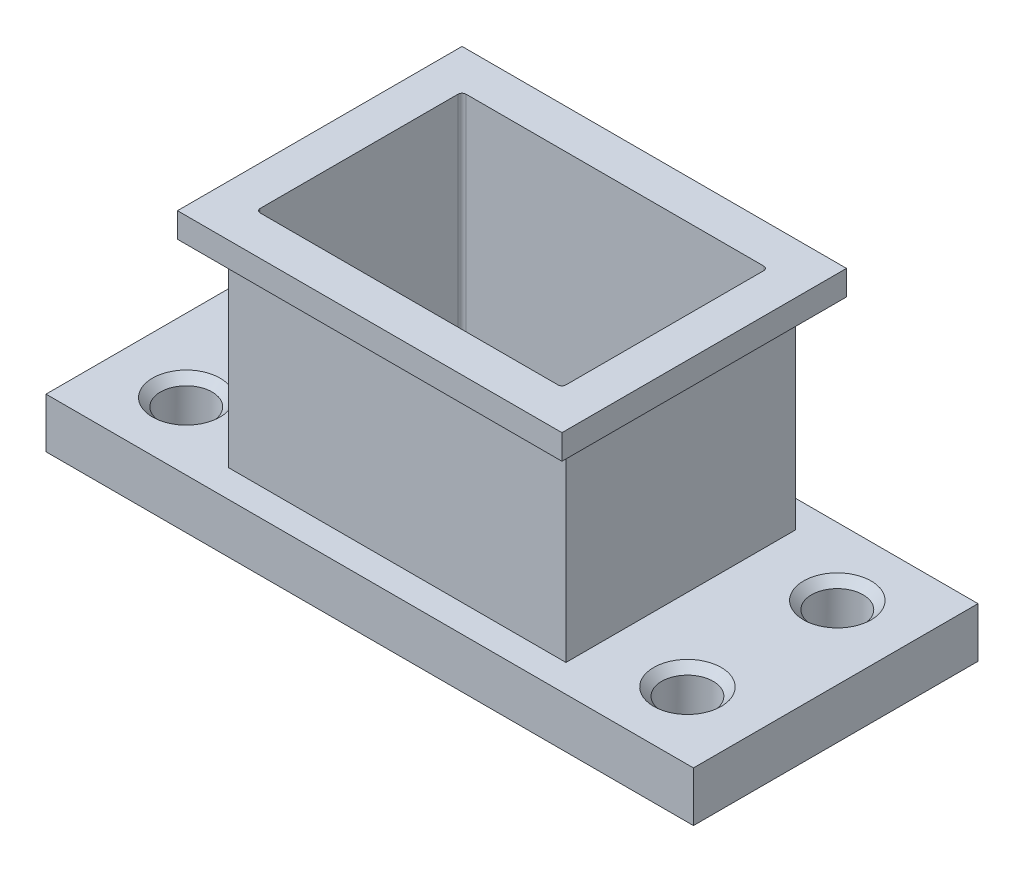
ISO-10303-21;
HEADER;
FILE_DESCRIPTION(('STEP AP214'),'2;1');
FILE_NAME('part.step','',(''),(''),'','','');
FILE_SCHEMA(('AUTOMOTIVE_DESIGN { 1 0 10303 214 1 1 1 1 }'));
ENDSEC;
DATA;
#1=APPLICATION_CONTEXT('core data for automotive mechanical design processes');
#2=APPLICATION_PROTOCOL_DEFINITION('international standard','automotive_design',2000,#1);
#3=PRODUCT_CONTEXT('',#1,'mechanical');
#4=PRODUCT('Part','Part','',(#3));
#5=PRODUCT_RELATED_PRODUCT_CATEGORY('part','',(#4));
#6=PRODUCT_DEFINITION_FORMATION('','',#4);
#7=PRODUCT_DEFINITION_CONTEXT('part definition',#1,'design');
#8=PRODUCT_DEFINITION('design','',#6,#7);
#9=PRODUCT_DEFINITION_SHAPE('','',#8);
#10=(LENGTH_UNIT() NAMED_UNIT(*) SI_UNIT(.MILLI.,.METRE.));
#11=(NAMED_UNIT(*) PLANE_ANGLE_UNIT() SI_UNIT($,.RADIAN.));
#12=(NAMED_UNIT(*) SI_UNIT($,.STERADIAN.) SOLID_ANGLE_UNIT());
#13=UNCERTAINTY_MEASURE_WITH_UNIT(LENGTH_MEASURE(1.E-05),#10,'distance_accuracy_value','');
#14=(GEOMETRIC_REPRESENTATION_CONTEXT(3) GLOBAL_UNCERTAINTY_ASSIGNED_CONTEXT((#13)) GLOBAL_UNIT_ASSIGNED_CONTEXT((#10,
#11,#12)) REPRESENTATION_CONTEXT('',''));
#15=CARTESIAN_POINT('',(0.,0.,0.));
#16=DIRECTION('',(0.,0.,1.));
#17=DIRECTION('',(1.,0.,0.));
#18=AXIS2_PLACEMENT_3D('',#15,#16,#17);
#19=CARTESIAN_POINT('',(0.,17.4498,0.));
#20=DIRECTION('',(0.,0.,-1.));
#21=DIRECTION('',(-1.,0.,0.));
#22=AXIS2_PLACEMENT_3D('',#19,#20,#21);
#23=PLANE('',#22);
#24=DIRECTION('',(0.,1.,0.));
#25=VECTOR('',#24,1.);
#26=CARTESIAN_POINT('',(8.35660000000001,3.175,0.));
#27=LINE('',#26,#25);
#28=CARTESIAN_POINT('',(8.35660000000001,15.875,0.));
#29=VERTEX_POINT('',#28);
#30=CARTESIAN_POINT('',(8.35660000000001,17.4498,0.));
#31=VERTEX_POINT('',#30);
#32=EDGE_CURVE('E230',#29,#31,#27,.T.);
#33=ORIENTED_EDGE('',*,*,#32,.F.);
#34=DIRECTION('',(1.,0.,0.));
#35=VECTOR('',#34,1.);
#36=CARTESIAN_POINT('',(8.35660000000001,15.875,0.));
#37=LINE('',#36,#35);
#38=CARTESIAN_POINT('',(32.7914,15.875,0.));
#39=VERTEX_POINT('',#38);
#40=EDGE_CURVE('E784',#29,#39,#37,.T.);
#41=ORIENTED_EDGE('',*,*,#40,.T.);
#42=DIRECTION('',(0.,1.,0.));
#43=VECTOR('',#42,1.);
#44=CARTESIAN_POINT('',(32.7914,3.175,0.));
#45=LINE('',#44,#43);
#46=CARTESIAN_POINT('',(32.7914,17.4498,0.));
#47=VERTEX_POINT('',#46);
#48=EDGE_CURVE('E218',#39,#47,#45,.T.);
#49=ORIENTED_EDGE('',*,*,#48,.T.);
#50=DIRECTION('',(1.,0.,0.));
#51=VECTOR('',#50,1.);
#52=CARTESIAN_POINT('',(0.,17.4498,0.));
#53=LINE('',#52,#51);
#54=EDGE_CURVE('E269',#31,#47,#53,.T.);
#55=ORIENTED_EDGE('',*,*,#54,.F.);
#56=EDGE_LOOP('',(#33,#41,#49,#55));
#57=FACE_BOUND('',#56,.T.);
#58=ADVANCED_FACE('F34',(#57),#23,.F.);
#59=CARTESIAN_POINT('',(0.,17.4498,-18.0848));
#60=DIRECTION('',(0.,0.,1.));
#61=DIRECTION('',(1.,0.,0.));
#62=AXIS2_PLACEMENT_3D('',#59,#60,#61);
#63=PLANE('',#62);
#64=DIRECTION('',(0.,1.,0.));
#65=VECTOR('',#64,1.);
#66=CARTESIAN_POINT('',(32.7914,3.17499999999997,-18.0848));
#67=LINE('',#66,#65);
#68=CARTESIAN_POINT('',(32.7914,15.875,-18.0848));
#69=VERTEX_POINT('',#68);
#70=CARTESIAN_POINT('',(32.7914,17.4498,-18.0848));
#71=VERTEX_POINT('',#70);
#72=EDGE_CURVE('E217',#69,#71,#67,.T.);
#73=ORIENTED_EDGE('',*,*,#72,.F.);
#74=DIRECTION('',(-1.,0.,0.));
#75=VECTOR('',#74,1.);
#76=CARTESIAN_POINT('',(32.7914,15.875,-18.0848));
#77=LINE('',#76,#75);
#78=CARTESIAN_POINT('',(8.35660000000001,15.875,-18.0848));
#79=VERTEX_POINT('',#78);
#80=EDGE_CURVE('E198',#69,#79,#77,.T.);
#81=ORIENTED_EDGE('',*,*,#80,.T.);
#82=DIRECTION('',(0.,1.,0.));
#83=VECTOR('',#82,1.);
#84=CARTESIAN_POINT('',(8.35660000000001,3.17499999999997,-18.0848));
#85=LINE('',#84,#83);
#86=CARTESIAN_POINT('',(8.35660000000001,17.4498,-18.0848));
#87=VERTEX_POINT('',#86);
#88=EDGE_CURVE('E231',#79,#87,#85,.T.);
#89=ORIENTED_EDGE('',*,*,#88,.T.);
#90=DIRECTION('',(-1.,0.,0.));
#91=VECTOR('',#90,1.);
#92=CARTESIAN_POINT('',(0.,17.4498,-18.0848));
#93=LINE('',#92,#91);
#94=EDGE_CURVE('E272',#71,#87,#93,.T.);
#95=ORIENTED_EDGE('',*,*,#94,.F.);
#96=EDGE_LOOP('',(#73,#81,#89,#95));
#97=FACE_BOUND('',#96,.T.);
#98=ADVANCED_FACE('F426',(#97),#63,.F.);
#99=CARTESIAN_POINT('',(0.,17.4498,0.));
#100=DIRECTION('',(1.,0.,0.));
#101=DIRECTION('',(0.,0.,-1.));
#102=AXIS2_PLACEMENT_3D('',#99,#100,#101);
#103=PLANE('',#102);
#104=DIRECTION('',(0.,0.,1.));
#105=VECTOR('',#104,1.);
#106=CARTESIAN_POINT('',(0.,3.17499999999997,-18.0848));
#107=LINE('',#106,#105);
#108=CARTESIAN_POINT('',(0.,3.17499999999997,-18.0848));
#109=VERTEX_POINT('',#108);
#110=CARTESIAN_POINT('',(0.,3.175,0.));
#111=VERTEX_POINT('',#110);
#112=EDGE_CURVE('E224',#109,#111,#107,.T.);
#113=ORIENTED_EDGE('',*,*,#112,.F.);
#114=DIRECTION('',(0.,-1.,0.));
#115=VECTOR('',#114,1.);
#116=CARTESIAN_POINT('',(0.,17.4498,-18.0848));
#117=LINE('',#116,#115);
#118=CARTESIAN_POINT('',(0.,0.,-18.0848));
#119=VERTEX_POINT('',#118);
#120=EDGE_CURVE('E275',#109,#119,#117,.T.);
#121=ORIENTED_EDGE('',*,*,#120,.T.);
#122=DIRECTION('',(0.,0.,1.));
#123=VECTOR('',#122,1.);
#124=CARTESIAN_POINT('',(0.,0.,0.));
#125=LINE('',#124,#123);
#126=CARTESIAN_POINT('',(0.,0.,0.));
#127=VERTEX_POINT('',#126);
#128=EDGE_CURVE('E257',#119,#127,#125,.T.);
#129=ORIENTED_EDGE('',*,*,#128,.T.);
#130=DIRECTION('',(0.,-1.,0.));
#131=VECTOR('',#130,1.);
#132=CARTESIAN_POINT('',(0.,17.4498,0.));
#133=LINE('',#132,#131);
#134=EDGE_CURVE('E281',#111,#127,#133,.T.);
#135=ORIENTED_EDGE('',*,*,#134,.F.);
#136=EDGE_LOOP('',(#113,#121,#129,#135));
#137=FACE_BOUND('',#136,.T.);
#138=ADVANCED_FACE('F36',(#137),#103,.F.);
#139=CARTESIAN_POINT('',(0.,17.4498,-18.0848));
#140=DIRECTION('',(0.,-1.,0.));
#141=DIRECTION('',(0.,0.,-1.));
#142=AXIS2_PLACEMENT_3D('',#139,#140,#141);
#143=PLANE('',#142);
#144=ORIENTED_EDGE('',*,*,#54,.T.);
#145=DIRECTION('',(0.,0.,1.));
#146=VECTOR('',#145,1.);
#147=CARTESIAN_POINT('',(32.7914,17.4498,-18.0848));
#148=LINE('',#147,#146);
#149=EDGE_CURVE('E204',#71,#47,#148,.T.);
#150=ORIENTED_EDGE('',*,*,#149,.F.);
#151=ORIENTED_EDGE('',*,*,#94,.T.);
#152=DIRECTION('',(0.,0.,-1.));
#153=VECTOR('',#152,1.);
#154=CARTESIAN_POINT('',(8.35660000000001,17.4498,-18.0848));
#155=LINE('',#154,#153);
#156=EDGE_CURVE('E220',#31,#87,#155,.T.);
#157=ORIENTED_EDGE('',*,*,#156,.F.);
#158=EDGE_LOOP('',(#144,#150,#151,#157));
#159=FACE_BOUND('',#158,.T.);
#160=DIRECTION('',(0.,0.,1.));
#161=VECTOR('',#160,1.);
#162=CARTESIAN_POINT('',(10.8585,17.4498,-15.5829));
#163=LINE('',#162,#161);
#164=CARTESIAN_POINT('',(10.8585,17.4498,-15.3289));
#165=VERTEX_POINT('',#164);
#166=CARTESIAN_POINT('',(10.8585,17.4498,-2.7559));
#167=VERTEX_POINT('',#166);
#168=EDGE_CURVE('E246',#165,#167,#163,.T.);
#169=ORIENTED_EDGE('',*,*,#168,.F.);
#170=CARTESIAN_POINT('',(11.1125,17.4498,-15.3289));
#171=DIRECTION('',(0.,-1.,0.));
#172=DIRECTION('',(0.,0.,-1.));
#173=AXIS2_PLACEMENT_3D('',#170,#171,#172);
#174=CIRCLE('',#173,0.254);
#175=CARTESIAN_POINT('',(11.1125,17.4498,-15.5829));
#176=VERTEX_POINT('',#175);
#177=EDGE_CURVE('E328',#165,#176,#174,.T.);
#178=ORIENTED_EDGE('',*,*,#177,.T.);
#179=DIRECTION('',(-1.,0.,0.));
#180=VECTOR('',#179,1.);
#181=CARTESIAN_POINT('',(10.8585,17.4498,-15.5829));
#182=LINE('',#181,#180);
#183=CARTESIAN_POINT('',(30.0355,17.4498,-15.5829));
#184=VERTEX_POINT('',#183);
#185=EDGE_CURVE('E254',#184,#176,#182,.T.);
#186=ORIENTED_EDGE('',*,*,#185,.F.);
#187=CARTESIAN_POINT('',(30.0355,17.4498,-15.3289));
#188=DIRECTION('',(0.,-1.,0.));
#189=DIRECTION('',(0.,0.,-1.));
#190=AXIS2_PLACEMENT_3D('',#187,#188,#189);
#191=CIRCLE('',#190,0.254);
#192=CARTESIAN_POINT('',(30.2895,17.4498,-15.3289));
#193=VERTEX_POINT('',#192);
#194=EDGE_CURVE('E49',#184,#193,#191,.T.);
#195=ORIENTED_EDGE('',*,*,#194,.T.);
#196=DIRECTION('',(0.,0.,-1.));
#197=VECTOR('',#196,1.);
#198=CARTESIAN_POINT('',(30.2895,17.4498,-15.5829));
#199=LINE('',#198,#197);
#200=CARTESIAN_POINT('',(30.2895,17.4498,-2.7559));
#201=VERTEX_POINT('',#200);
#202=EDGE_CURVE('E252',#201,#193,#199,.T.);
#203=ORIENTED_EDGE('',*,*,#202,.F.);
#204=CARTESIAN_POINT('',(30.0355,17.4498,-2.75590000000001));
#205=DIRECTION('',(0.,-1.,0.));
#206=DIRECTION('',(0.,0.,-1.));
#207=AXIS2_PLACEMENT_3D('',#204,#205,#206);
#208=CIRCLE('',#207,0.254);
#209=CARTESIAN_POINT('',(30.0355,17.4498,-2.50190000000001));
#210=VERTEX_POINT('',#209);
#211=EDGE_CURVE('E336',#201,#210,#208,.T.);
#212=ORIENTED_EDGE('',*,*,#211,.T.);
#213=DIRECTION('',(1.,0.,0.));
#214=VECTOR('',#213,1.);
#215=CARTESIAN_POINT('',(10.8585,17.4498,-2.5019));
#216=LINE('',#215,#214);
#217=CARTESIAN_POINT('',(11.1125,17.4498,-2.5019));
#218=VERTEX_POINT('',#217);
#219=EDGE_CURVE('E249',#218,#210,#216,.T.);
#220=ORIENTED_EDGE('',*,*,#219,.F.);
#221=CARTESIAN_POINT('',(11.1125,17.4498,-2.7559));
#222=DIRECTION('',(0.,-1.,0.));
#223=DIRECTION('',(0.,0.,-1.));
#224=AXIS2_PLACEMENT_3D('',#221,#222,#223);
#225=CIRCLE('',#224,0.254);
#226=EDGE_CURVE('E332',#218,#167,#225,.T.);
#227=ORIENTED_EDGE('',*,*,#226,.T.);
#228=EDGE_LOOP('',(#169,#178,#186,#195,#203,#212,#220,#227));
#229=FACE_BOUND('',#228,.T.);
#230=ADVANCED_FACE('F376',(#159,#229),#143,.F.);
#231=CARTESIAN_POINT('',(0.,0.,-18.0848));
#232=DIRECTION('',(0.,-1.,0.));
#233=DIRECTION('',(0.,0.,-1.));
#234=AXIS2_PLACEMENT_3D('',#231,#232,#233);
#235=PLANE('',#234);
#236=CARTESIAN_POINT('',(4.6482,0.,-4.2672));
#237=DIRECTION('',(0.,-1.,0.));
#238=DIRECTION('',(0.,0.,-1.));
#239=AXIS2_PLACEMENT_3D('',#236,#237,#238);
#240=CIRCLE('',#239,2.1463);
#241=CARTESIAN_POINT('',(4.6482,0.,-6.41350000000001));
#242=VERTEX_POINT('',#241);
#243=EDGE_CURVE('E350',#242,#242,#240,.F.);
#244=ORIENTED_EDGE('',*,*,#243,.T.);
#245=EDGE_LOOP('',(#244));
#246=FACE_BOUND('',#245,.T.);
#247=CARTESIAN_POINT('',(4.6482,0.,-13.7922));
#248=DIRECTION('',(0.,-1.,0.));
#249=DIRECTION('',(0.,0.,-1.));
#250=AXIS2_PLACEMENT_3D('',#247,#248,#249);
#251=CIRCLE('',#250,2.1463);
#252=CARTESIAN_POINT('',(4.6482,0.,-15.9385));
#253=VERTEX_POINT('',#252);
#254=EDGE_CURVE('E347',#253,#253,#251,.F.);
#255=ORIENTED_EDGE('',*,*,#254,.T.);
#256=EDGE_LOOP('',(#255));
#257=FACE_BOUND('',#256,.T.);
#258=CARTESIAN_POINT('',(36.4998,0.,-13.7922));
#259=DIRECTION('',(0.,-1.,0.));
#260=DIRECTION('',(0.,0.,-1.));
#261=AXIS2_PLACEMENT_3D('',#258,#259,#260);
#262=CIRCLE('',#261,2.1463);
#263=CARTESIAN_POINT('',(36.4998,0.,-15.9385));
#264=VERTEX_POINT('',#263);
#265=EDGE_CURVE('E344',#264,#264,#262,.F.);
#266=ORIENTED_EDGE('',*,*,#265,.T.);
#267=EDGE_LOOP('',(#266));
#268=FACE_BOUND('',#267,.T.);
#269=CARTESIAN_POINT('',(36.4998,0.,-4.2672));
#270=DIRECTION('',(0.,-1.,0.));
#271=DIRECTION('',(0.,0.,-1.));
#272=AXIS2_PLACEMENT_3D('',#269,#270,#271);
#273=CIRCLE('',#272,2.1463);
#274=CARTESIAN_POINT('',(36.4998,0.,-6.41350000000001));
#275=VERTEX_POINT('',#274);
#276=EDGE_CURVE('E341',#275,#275,#273,.F.);
#277=ORIENTED_EDGE('',*,*,#276,.T.);
#278=EDGE_LOOP('',(#277));
#279=FACE_BOUND('',#278,.T.);
#280=ORIENTED_EDGE('',*,*,#128,.F.);
#281=DIRECTION('',(-1.,0.,0.));
#282=VECTOR('',#281,1.);
#283=CARTESIAN_POINT('',(0.,0.,-18.0848));
#284=LINE('',#283,#282);
#285=CARTESIAN_POINT('',(41.148,0.,-18.0848));
#286=VERTEX_POINT('',#285);
#287=EDGE_CURVE('E266',#286,#119,#284,.T.);
#288=ORIENTED_EDGE('',*,*,#287,.F.);
#289=DIRECTION('',(0.,0.,-1.));
#290=VECTOR('',#289,1.);
#291=CARTESIAN_POINT('',(41.148,0.,0.));
#292=LINE('',#291,#290);
#293=CARTESIAN_POINT('',(41.148,0.,0.));
#294=VERTEX_POINT('',#293);
#295=EDGE_CURVE('E263',#294,#286,#292,.T.);
#296=ORIENTED_EDGE('',*,*,#295,.F.);
#297=DIRECTION('',(1.,0.,0.));
#298=VECTOR('',#297,1.);
#299=CARTESIAN_POINT('',(0.,0.,0.));
#300=LINE('',#299,#298);
#301=EDGE_CURVE('E260',#127,#294,#300,.T.);
#302=ORIENTED_EDGE('',*,*,#301,.F.);
#303=EDGE_LOOP('',(#280,#288,#296,#302));
#304=FACE_BOUND('',#303,.T.);
#305=DIRECTION('',(0.,0.,-1.));
#306=VECTOR('',#305,1.);
#307=CARTESIAN_POINT('',(30.2895,0.,-15.5829));
#308=LINE('',#307,#306);
#309=CARTESIAN_POINT('',(30.2895,0.,-2.75590000000001));
#310=VERTEX_POINT('',#309);
#311=CARTESIAN_POINT('',(30.2895,0.,-15.3289));
#312=VERTEX_POINT('',#311);
#313=EDGE_CURVE('E240',#310,#312,#308,.T.);
#314=ORIENTED_EDGE('',*,*,#313,.T.);
#315=CARTESIAN_POINT('',(30.0355,0.,-15.3289));
#316=DIRECTION('',(0.,-1.,0.));
#317=DIRECTION('',(0.,0.,-1.));
#318=AXIS2_PLACEMENT_3D('',#315,#316,#317);
#319=CIRCLE('',#318,0.254);
#320=CARTESIAN_POINT('',(30.0355,0.,-15.5829));
#321=VERTEX_POINT('',#320);
#322=EDGE_CURVE('E338',#312,#321,#319,.F.);
#323=ORIENTED_EDGE('',*,*,#322,.T.);
#324=DIRECTION('',(-1.,0.,0.));
#325=VECTOR('',#324,1.);
#326=CARTESIAN_POINT('',(10.8585,0.,-15.5829));
#327=LINE('',#326,#325);
#328=CARTESIAN_POINT('',(11.1125,0.,-15.5829));
#329=VERTEX_POINT('',#328);
#330=EDGE_CURVE('E243',#321,#329,#327,.T.);
#331=ORIENTED_EDGE('',*,*,#330,.T.);
#332=CARTESIAN_POINT('',(11.1125,0.,-15.3289));
#333=DIRECTION('',(0.,-1.,0.));
#334=DIRECTION('',(0.,0.,-1.));
#335=AXIS2_PLACEMENT_3D('',#332,#333,#334);
#336=CIRCLE('',#335,0.254);
#337=CARTESIAN_POINT('',(10.8585,0.,-15.3289));
#338=VERTEX_POINT('',#337);
#339=EDGE_CURVE('E326',#329,#338,#336,.F.);
#340=ORIENTED_EDGE('',*,*,#339,.T.);
#341=DIRECTION('',(0.,0.,1.));
#342=VECTOR('',#341,1.);
#343=CARTESIAN_POINT('',(10.8585,0.,-15.5829));
#344=LINE('',#343,#342);
#345=CARTESIAN_POINT('',(10.8585,0.,-2.7559));
#346=VERTEX_POINT('',#345);
#347=EDGE_CURVE('E233',#338,#346,#344,.T.);
#348=ORIENTED_EDGE('',*,*,#347,.T.);
#349=CARTESIAN_POINT('',(11.1125,0.,-2.7559));
#350=DIRECTION('',(0.,-1.,0.));
#351=DIRECTION('',(0.,0.,-1.));
#352=AXIS2_PLACEMENT_3D('',#349,#350,#351);
#353=CIRCLE('',#352,0.254);
#354=CARTESIAN_POINT('',(11.1125,0.,-2.5019));
#355=VERTEX_POINT('',#354);
#356=EDGE_CURVE('E330',#346,#355,#353,.F.);
#357=ORIENTED_EDGE('',*,*,#356,.T.);
#358=DIRECTION('',(1.,0.,0.));
#359=VECTOR('',#358,1.);
#360=CARTESIAN_POINT('',(10.8585,0.,-2.5019));
#361=LINE('',#360,#359);
#362=CARTESIAN_POINT('',(30.0355,0.,-2.50190000000001));
#363=VERTEX_POINT('',#362);
#364=EDGE_CURVE('E237',#355,#363,#361,.T.);
#365=ORIENTED_EDGE('',*,*,#364,.T.);
#366=CARTESIAN_POINT('',(30.0355,0.,-2.75590000000001));
#367=DIRECTION('',(0.,-1.,0.));
#368=DIRECTION('',(0.,0.,-1.));
#369=AXIS2_PLACEMENT_3D('',#366,#367,#368);
#370=CIRCLE('',#369,0.254);
#371=EDGE_CURVE('E334',#363,#310,#370,.F.);
#372=ORIENTED_EDGE('',*,*,#371,.T.);
#373=EDGE_LOOP('',(#314,#323,#331,#340,#348,#357,#365,#372));
#374=FACE_BOUND('',#373,.T.);
#375=ADVANCED_FACE('F372',(#246,#257,#268,#279,#304,#374),#235,.T.);
#376=DIRECTION('',(0.,-1.,0.));
#377=VECTOR('',#376,1.);
#378=CARTESIAN_POINT('',(41.148,17.4498,0.));
#379=LINE('',#378,#377);
#380=CARTESIAN_POINT('',(41.148,3.175,0.));
#381=VERTEX_POINT('',#380);
#382=EDGE_CURVE('E279',#381,#294,#379,.T.);
#383=ORIENTED_EDGE('',*,*,#382,.F.);
#384=DIRECTION('',(1.,0.,0.));
#385=VECTOR('',#384,1.);
#386=CARTESIAN_POINT('',(0.,3.175,0.));
#387=LINE('',#386,#385);
#388=EDGE_CURVE('E226',#111,#381,#387,.T.);
#389=ORIENTED_EDGE('',*,*,#388,.F.);
#390=ORIENTED_EDGE('',*,*,#134,.T.);
#391=ORIENTED_EDGE('',*,*,#301,.T.);
#392=EDGE_LOOP('',(#383,#389,#390,#391));
#393=FACE_BOUND('',#392,.T.);
#394=ADVANCED_FACE('F375',(#393),#23,.F.);
#395=CARTESIAN_POINT('',(41.148,17.4498,0.));
#396=DIRECTION('',(-1.,0.,0.));
#397=DIRECTION('',(0.,0.,1.));
#398=AXIS2_PLACEMENT_3D('',#395,#396,#397);
#399=PLANE('',#398);
#400=DIRECTION('',(0.,-1.,0.));
#401=VECTOR('',#400,1.);
#402=CARTESIAN_POINT('',(41.148,17.4498,-18.0848));
#403=LINE('',#402,#401);
#404=CARTESIAN_POINT('',(41.148,3.17499999999997,-18.0848));
#405=VERTEX_POINT('',#404);
#406=EDGE_CURVE('E277',#405,#286,#403,.T.);
#407=ORIENTED_EDGE('',*,*,#406,.F.);
#408=DIRECTION('',(0.,0.,-1.));
#409=VECTOR('',#408,1.);
#410=CARTESIAN_POINT('',(41.148,3.17499999999997,-18.0848));
#411=LINE('',#410,#409);
#412=EDGE_CURVE('E214',#381,#405,#411,.T.);
#413=ORIENTED_EDGE('',*,*,#412,.F.);
#414=ORIENTED_EDGE('',*,*,#382,.T.);
#415=ORIENTED_EDGE('',*,*,#295,.T.);
#416=EDGE_LOOP('',(#407,#413,#414,#415));
#417=FACE_BOUND('',#416,.T.);
#418=ADVANCED_FACE('F437',(#417),#399,.F.);
#419=DIRECTION('',(-1.,0.,0.));
#420=VECTOR('',#419,1.);
#421=CARTESIAN_POINT('',(0.,3.17499999999997,-18.0848));
#422=LINE('',#421,#420);
#423=EDGE_CURVE('E228',#405,#109,#422,.T.);
#424=ORIENTED_EDGE('',*,*,#423,.F.);
#425=ORIENTED_EDGE('',*,*,#406,.T.);
#426=ORIENTED_EDGE('',*,*,#287,.T.);
#427=ORIENTED_EDGE('',*,*,#120,.F.);
#428=EDGE_LOOP('',(#424,#425,#426,#427));
#429=FACE_BOUND('',#428,.T.);
#430=ADVANCED_FACE('F433',(#429),#63,.F.);
#431=CARTESIAN_POINT('',(10.8585,17.4498,-15.5829));
#432=DIRECTION('',(1.,0.,0.));
#433=DIRECTION('',(0.,0.,-1.));
#434=AXIS2_PLACEMENT_3D('',#431,#432,#433);
#435=PLANE('',#434);
#436=ORIENTED_EDGE('',*,*,#347,.F.);
#437=DIRECTION('',(0.,-1.,0.));
#438=VECTOR('',#437,1.);
#439=CARTESIAN_POINT('',(10.8585,17.4498,-15.3289));
#440=LINE('',#439,#438);
#441=EDGE_CURVE('E315',#338,#165,#440,.F.);
#442=ORIENTED_EDGE('',*,*,#441,.T.);
#443=ORIENTED_EDGE('',*,*,#168,.T.);
#444=DIRECTION('',(0.,-1.,0.));
#445=VECTOR('',#444,1.);
#446=CARTESIAN_POINT('',(10.8585,0.,-2.7559));
#447=LINE('',#446,#445);
#448=EDGE_CURVE('E312',#167,#346,#447,.T.);
#449=ORIENTED_EDGE('',*,*,#448,.T.);
#450=EDGE_LOOP('',(#436,#442,#443,#449));
#451=FACE_BOUND('',#450,.T.);
#452=ADVANCED_FACE('F405',(#451),#435,.T.);
#453=CARTESIAN_POINT('',(10.8585,17.4498,-2.5019));
#454=DIRECTION('',(0.,0.,-1.));
#455=DIRECTION('',(-1.,0.,0.));
#456=AXIS2_PLACEMENT_3D('',#453,#454,#455);
#457=PLANE('',#456);
#458=ORIENTED_EDGE('',*,*,#364,.F.);
#459=DIRECTION('',(0.,-1.,0.));
#460=VECTOR('',#459,1.);
#461=CARTESIAN_POINT('',(11.1125,17.4498,-2.5019));
#462=LINE('',#461,#460);
#463=EDGE_CURVE('E320',#355,#218,#462,.F.);
#464=ORIENTED_EDGE('',*,*,#463,.T.);
#465=ORIENTED_EDGE('',*,*,#219,.T.);
#466=DIRECTION('',(0.,-1.,0.));
#467=VECTOR('',#466,1.);
#468=CARTESIAN_POINT('',(30.0355,0.,-2.50190000000001));
#469=LINE('',#468,#467);
#470=EDGE_CURVE('E317',#210,#363,#469,.T.);
#471=ORIENTED_EDGE('',*,*,#470,.T.);
#472=EDGE_LOOP('',(#458,#464,#465,#471));
#473=FACE_BOUND('',#472,.T.);
#474=ADVANCED_FACE('F397',(#473),#457,.T.);
#475=CARTESIAN_POINT('',(30.2895,17.4498,-15.5829));
#476=DIRECTION('',(-1.,0.,0.));
#477=DIRECTION('',(0.,0.,1.));
#478=AXIS2_PLACEMENT_3D('',#475,#476,#477);
#479=PLANE('',#478);
#480=ORIENTED_EDGE('',*,*,#313,.F.);
#481=DIRECTION('',(0.,-1.,0.));
#482=VECTOR('',#481,1.);
#483=CARTESIAN_POINT('',(30.2895,17.4498,-2.7559));
#484=LINE('',#483,#482);
#485=EDGE_CURVE('E56',#310,#201,#484,.F.);
#486=ORIENTED_EDGE('',*,*,#485,.T.);
#487=ORIENTED_EDGE('',*,*,#202,.T.);
#488=DIRECTION('',(0.,-1.,0.));
#489=VECTOR('',#488,1.);
#490=CARTESIAN_POINT('',(30.2895,0.,-15.3289));
#491=LINE('',#490,#489);
#492=EDGE_CURVE('E322',#193,#312,#491,.T.);
#493=ORIENTED_EDGE('',*,*,#492,.T.);
#494=EDGE_LOOP('',(#480,#486,#487,#493));
#495=FACE_BOUND('',#494,.T.);
#496=ADVANCED_FACE('F386',(#495),#479,.T.);
#497=CARTESIAN_POINT('',(10.8585,17.4498,-15.5829));
#498=DIRECTION('',(0.,0.,1.));
#499=DIRECTION('',(1.,0.,0.));
#500=AXIS2_PLACEMENT_3D('',#497,#498,#499);
#501=PLANE('',#500);
#502=ORIENTED_EDGE('',*,*,#185,.T.);
#503=DIRECTION('',(0.,-1.,0.));
#504=VECTOR('',#503,1.);
#505=CARTESIAN_POINT('',(11.1125,0.,-15.5829));
#506=LINE('',#505,#504);
#507=EDGE_CURVE('E309',#176,#329,#506,.T.);
#508=ORIENTED_EDGE('',*,*,#507,.T.);
#509=ORIENTED_EDGE('',*,*,#330,.F.);
#510=DIRECTION('',(0.,-1.,0.));
#511=VECTOR('',#510,1.);
#512=CARTESIAN_POINT('',(30.0355,17.4498,-15.5829));
#513=LINE('',#512,#511);
#514=EDGE_CURVE('E307',#321,#184,#513,.F.);
#515=ORIENTED_EDGE('',*,*,#514,.T.);
#516=EDGE_LOOP('',(#502,#508,#509,#515));
#517=FACE_BOUND('',#516,.T.);
#518=ADVANCED_FACE('F411',(#517),#501,.T.);
#519=CARTESIAN_POINT('',(8.35660000000001,3.17499999999997,-18.0848));
#520=DIRECTION('',(1.,0.,0.));
#521=DIRECTION('',(0.,0.,-1.));
#522=AXIS2_PLACEMENT_3D('',#519,#520,#521);
#523=PLANE('',#522);
#524=ORIENTED_EDGE('',*,*,#88,.F.);
#525=DIRECTION('',(0.,0.,1.));
#526=VECTOR('',#525,1.);
#527=CARTESIAN_POINT('',(8.35660000000001,15.875,-18.0848));
#528=LINE('',#527,#526);
#529=EDGE_CURVE('E780',#79,#29,#528,.T.);
#530=ORIENTED_EDGE('',*,*,#529,.T.);
#531=ORIENTED_EDGE('',*,*,#32,.T.);
#532=ORIENTED_EDGE('',*,*,#156,.T.);
#533=EDGE_LOOP('',(#524,#530,#531,#532));
#534=FACE_BOUND('',#533,.T.);
#535=ADVANCED_FACE('F469',(#534),#523,.F.);
#536=CARTESIAN_POINT('',(0.,3.175,0.));
#537=DIRECTION('',(0.,1.,0.));
#538=DIRECTION('',(0.,0.,1.));
#539=AXIS2_PLACEMENT_3D('',#536,#537,#538);
#540=PLANE('',#539);
#541=CARTESIAN_POINT('',(4.6482,3.175,-13.7922));
#542=DIRECTION('',(0.,1.,0.));
#543=DIRECTION('',(0.,0.,1.));
#544=AXIS2_PLACEMENT_3D('',#541,#542,#543);
#545=CIRCLE('',#544,2.1463);
#546=CARTESIAN_POINT('',(4.6482,3.175,-11.6459));
#547=VERTEX_POINT('',#546);
#548=EDGE_CURVE('E295',#547,#547,#545,.F.);
#549=ORIENTED_EDGE('',*,*,#548,.T.);
#550=EDGE_LOOP('',(#549));
#551=FACE_BOUND('',#550,.T.);
#552=CARTESIAN_POINT('',(4.6482,3.175,-4.2672));
#553=DIRECTION('',(0.,1.,0.));
#554=DIRECTION('',(0.,0.,1.));
#555=AXIS2_PLACEMENT_3D('',#552,#553,#554);
#556=CIRCLE('',#555,2.1463);
#557=CARTESIAN_POINT('',(4.6482,3.175,-2.1209));
#558=VERTEX_POINT('',#557);
#559=EDGE_CURVE('E292',#558,#558,#556,.F.);
#560=ORIENTED_EDGE('',*,*,#559,.T.);
#561=EDGE_LOOP('',(#560));
#562=FACE_BOUND('',#561,.T.);
#563=CARTESIAN_POINT('',(36.4998,3.175,-4.2672));
#564=DIRECTION('',(0.,1.,0.));
#565=DIRECTION('',(0.,0.,1.));
#566=AXIS2_PLACEMENT_3D('',#563,#564,#565);
#567=CIRCLE('',#566,2.1463);
#568=CARTESIAN_POINT('',(36.4998,3.175,-2.1209));
#569=VERTEX_POINT('',#568);
#570=EDGE_CURVE('E289',#569,#569,#567,.F.);
#571=ORIENTED_EDGE('',*,*,#570,.T.);
#572=EDGE_LOOP('',(#571));
#573=FACE_BOUND('',#572,.T.);
#574=CARTESIAN_POINT('',(36.4998,3.175,-13.7922));
#575=DIRECTION('',(0.,1.,0.));
#576=DIRECTION('',(0.,0.,1.));
#577=AXIS2_PLACEMENT_3D('',#574,#575,#576);
#578=CIRCLE('',#577,2.14630000000002);
#579=CARTESIAN_POINT('',(36.4998,3.175,-11.6459));
#580=VERTEX_POINT('',#579);
#581=EDGE_CURVE('E286',#580,#580,#578,.F.);
#582=ORIENTED_EDGE('',*,*,#581,.T.);
#583=EDGE_LOOP('',(#582));
#584=FACE_BOUND('',#583,.T.);
#585=ORIENTED_EDGE('',*,*,#112,.T.);
#586=ORIENTED_EDGE('',*,*,#388,.T.);
#587=ORIENTED_EDGE('',*,*,#412,.T.);
#588=ORIENTED_EDGE('',*,*,#423,.T.);
#589=EDGE_LOOP('',(#585,#586,#587,#588));
#590=FACE_BOUND('',#589,.T.);
#591=DIRECTION('',(1.,0.,0.));
#592=VECTOR('',#591,1.);
#593=CARTESIAN_POINT('',(31.2928,3.175,-1.7526));
#594=LINE('',#593,#592);
#595=CARTESIAN_POINT('',(9.85520000000001,3.175,-1.7526));
#596=VERTEX_POINT('',#595);
#597=CARTESIAN_POINT('',(31.2928,3.175,-1.7526));
#598=VERTEX_POINT('',#597);
#599=EDGE_CURVE('E196',#596,#598,#594,.T.);
#600=ORIENTED_EDGE('',*,*,#599,.F.);
#601=DIRECTION('',(0.,0.,1.));
#602=VECTOR('',#601,1.);
#603=CARTESIAN_POINT('',(9.85520000000001,3.175,-16.3322));
#604=LINE('',#603,#602);
#605=CARTESIAN_POINT('',(9.85520000000001,3.175,-16.3322));
#606=VERTEX_POINT('',#605);
#607=EDGE_CURVE('E191',#606,#596,#604,.T.);
#608=ORIENTED_EDGE('',*,*,#607,.F.);
#609=DIRECTION('',(-1.,0.,0.));
#610=VECTOR('',#609,1.);
#611=CARTESIAN_POINT('',(31.2928,3.175,-16.3322));
#612=LINE('',#611,#610);
#613=CARTESIAN_POINT('',(31.2928,3.175,-16.3322));
#614=VERTEX_POINT('',#613);
#615=EDGE_CURVE('E176',#614,#606,#612,.T.);
#616=ORIENTED_EDGE('',*,*,#615,.F.);
#617=DIRECTION('',(0.,0.,-1.));
#618=VECTOR('',#617,1.);
#619=CARTESIAN_POINT('',(31.2928,3.175,-16.3322));
#620=LINE('',#619,#618);
#621=EDGE_CURVE('E188',#598,#614,#620,.T.);
#622=ORIENTED_EDGE('',*,*,#621,.F.);
#623=EDGE_LOOP('',(#600,#608,#616,#622));
#624=FACE_BOUND('',#623,.T.);
#625=ADVANCED_FACE('F187',(#551,#562,#573,#584,#590,#624),#540,.T.);
#626=CARTESIAN_POINT('',(32.7914,3.17499999999997,-18.0848));
#627=DIRECTION('',(-1.,0.,0.));
#628=DIRECTION('',(0.,0.,1.));
#629=AXIS2_PLACEMENT_3D('',#626,#627,#628);
#630=PLANE('',#629);
#631=ORIENTED_EDGE('',*,*,#48,.F.);
#632=DIRECTION('',(0.,0.,-1.));
#633=VECTOR('',#632,1.);
#634=CARTESIAN_POINT('',(32.7914,15.875,0.));
#635=LINE('',#634,#633);
#636=EDGE_CURVE('E789',#39,#69,#635,.T.);
#637=ORIENTED_EDGE('',*,*,#636,.T.);
#638=ORIENTED_EDGE('',*,*,#72,.T.);
#639=ORIENTED_EDGE('',*,*,#149,.T.);
#640=EDGE_LOOP('',(#631,#637,#638,#639));
#641=FACE_BOUND('',#640,.T.);
#642=ADVANCED_FACE('F475',(#641),#630,.F.);
#643=CARTESIAN_POINT('',(31.2928,-27.2243329216284,-16.3322));
#644=DIRECTION('',(1.,0.,0.));
#645=DIRECTION('',(0.,0.,-1.));
#646=AXIS2_PLACEMENT_3D('',#643,#644,#645);
#647=PLANE('',#646);
#648=ORIENTED_EDGE('',*,*,#621,.T.);
#649=DIRECTION('',(0.,1.,0.));
#650=VECTOR('',#649,1.);
#651=CARTESIAN_POINT('',(31.2928,-27.2243329216284,-16.3322));
#652=LINE('',#651,#650);
#653=CARTESIAN_POINT('',(31.2928,15.875,-16.3322));
#654=VERTEX_POINT('',#653);
#655=EDGE_CURVE('E173',#614,#654,#652,.T.);
#656=ORIENTED_EDGE('',*,*,#655,.T.);
#657=DIRECTION('',(0.,0.,-1.));
#658=VECTOR('',#657,1.);
#659=CARTESIAN_POINT('',(31.2928,15.875,-16.3322));
#660=LINE('',#659,#658);
#661=CARTESIAN_POINT('',(31.2928,15.875,-1.75260000000001));
#662=VERTEX_POINT('',#661);
#663=EDGE_CURVE('E201',#662,#654,#660,.T.);
#664=ORIENTED_EDGE('',*,*,#663,.F.);
#665=DIRECTION('',(0.,1.,0.));
#666=VECTOR('',#665,1.);
#667=CARTESIAN_POINT('',(31.2928,-27.2243329216284,-1.75260000000001));
#668=LINE('',#667,#666);
#669=EDGE_CURVE('E194',#598,#662,#668,.T.);
#670=ORIENTED_EDGE('',*,*,#669,.F.);
#671=EDGE_LOOP('',(#648,#656,#664,#670));
#672=FACE_BOUND('',#671,.T.);
#673=ADVANCED_FACE('F193',(#672),#647,.T.);
#674=CARTESIAN_POINT('',(31.2928,-27.2243329216284,-1.75260000000001));
#675=DIRECTION('',(0.,0.,1.));
#676=DIRECTION('',(1.,0.,0.));
#677=AXIS2_PLACEMENT_3D('',#674,#675,#676);
#678=PLANE('',#677);
#679=ORIENTED_EDGE('',*,*,#599,.T.);
#680=ORIENTED_EDGE('',*,*,#669,.T.);
#681=DIRECTION('',(1.,0.,0.));
#682=VECTOR('',#681,1.);
#683=CARTESIAN_POINT('',(31.2928,15.875,-1.75260000000001));
#684=LINE('',#683,#682);
#685=CARTESIAN_POINT('',(9.85520000000001,15.875,-1.7526));
#686=VERTEX_POINT('',#685);
#687=EDGE_CURVE('E209',#686,#662,#684,.T.);
#688=ORIENTED_EDGE('',*,*,#687,.F.);
#689=DIRECTION('',(0.,1.,0.));
#690=VECTOR('',#689,1.);
#691=CARTESIAN_POINT('',(9.85520000000001,-27.2243329216284,-1.7526));
#692=LINE('',#691,#690);
#693=EDGE_CURVE('E207',#596,#686,#692,.T.);
#694=ORIENTED_EDGE('',*,*,#693,.F.);
#695=EDGE_LOOP('',(#679,#680,#688,#694));
#696=FACE_BOUND('',#695,.T.);
#697=ADVANCED_FACE('F482',(#696),#678,.T.);
#698=CARTESIAN_POINT('',(9.85520000000001,-27.2243329216284,-16.3322));
#699=DIRECTION('',(-1.,0.,0.));
#700=DIRECTION('',(0.,0.,1.));
#701=AXIS2_PLACEMENT_3D('',#698,#699,#700);
#702=PLANE('',#701);
#703=ORIENTED_EDGE('',*,*,#607,.T.);
#704=ORIENTED_EDGE('',*,*,#693,.T.);
#705=DIRECTION('',(0.,0.,1.));
#706=VECTOR('',#705,1.);
#707=CARTESIAN_POINT('',(9.85520000000001,15.875,-16.3322));
#708=LINE('',#707,#706);
#709=CARTESIAN_POINT('',(9.85520000000001,15.875,-16.3322));
#710=VERTEX_POINT('',#709);
#711=EDGE_CURVE('E183',#710,#686,#708,.T.);
#712=ORIENTED_EDGE('',*,*,#711,.F.);
#713=DIRECTION('',(0.,1.,0.));
#714=VECTOR('',#713,1.);
#715=CARTESIAN_POINT('',(9.85520000000001,-27.2243329216284,-16.3322));
#716=LINE('',#715,#714);
#717=EDGE_CURVE('E210',#606,#710,#716,.T.);
#718=ORIENTED_EDGE('',*,*,#717,.F.);
#719=EDGE_LOOP('',(#703,#704,#712,#718));
#720=FACE_BOUND('',#719,.T.);
#721=ADVANCED_FACE('F485',(#720),#702,.T.);
#722=CARTESIAN_POINT('',(31.2928,-27.2243329216284,-16.3322));
#723=DIRECTION('',(0.,0.,-1.));
#724=DIRECTION('',(-1.,0.,0.));
#725=AXIS2_PLACEMENT_3D('',#722,#723,#724);
#726=PLANE('',#725);
#727=ORIENTED_EDGE('',*,*,#615,.T.);
#728=ORIENTED_EDGE('',*,*,#717,.T.);
#729=DIRECTION('',(-1.,0.,0.));
#730=VECTOR('',#729,1.);
#731=CARTESIAN_POINT('',(31.2928,15.875,-16.3322));
#732=LINE('',#731,#730);
#733=EDGE_CURVE('E178',#654,#710,#732,.T.);
#734=ORIENTED_EDGE('',*,*,#733,.F.);
#735=ORIENTED_EDGE('',*,*,#655,.F.);
#736=EDGE_LOOP('',(#727,#728,#734,#735));
#737=FACE_BOUND('',#736,.T.);
#738=ADVANCED_FACE('F175',(#737),#726,.T.);
#739=CARTESIAN_POINT('',(8.35660000000001,15.875,0.));
#740=DIRECTION('',(0.,1.,0.));
#741=DIRECTION('',(0.,0.,1.));
#742=AXIS2_PLACEMENT_3D('',#739,#740,#741);
#743=PLANE('',#742);
#744=ORIENTED_EDGE('',*,*,#663,.T.);
#745=ORIENTED_EDGE('',*,*,#733,.T.);
#746=ORIENTED_EDGE('',*,*,#711,.T.);
#747=ORIENTED_EDGE('',*,*,#687,.T.);
#748=EDGE_LOOP('',(#744,#745,#746,#747));
#749=FACE_BOUND('',#748,.T.);
#750=ORIENTED_EDGE('',*,*,#529,.F.);
#751=ORIENTED_EDGE('',*,*,#80,.F.);
#752=ORIENTED_EDGE('',*,*,#636,.F.);
#753=ORIENTED_EDGE('',*,*,#40,.F.);
#754=EDGE_LOOP('',(#750,#751,#752,#753));
#755=FACE_BOUND('',#754,.T.);
#756=ADVANCED_FACE('F492',(#749,#755),#743,.F.);
#757=CARTESIAN_POINT('',(36.4998,0.,-13.7922));
#758=DIRECTION('',(0.,1.,0.));
#759=DIRECTION('',(0.,0.,1.));
#760=AXIS2_PLACEMENT_3D('',#757,#758,#759);
#761=CYLINDRICAL_SURFACE('',#760,1.6383);
#762=CARTESIAN_POINT('',(36.4998,0.508000000000002,-13.7922));
#763=DIRECTION('',(0.,-1.,0.));
#764=DIRECTION('',(0.,0.,-1.));
#765=AXIS2_PLACEMENT_3D('',#762,#763,#764);
#766=CIRCLE('',#765,1.6383);
#767=CARTESIAN_POINT('',(36.4998,0.508000000000002,-15.4305));
#768=VERTEX_POINT('',#767);
#769=EDGE_CURVE('E42',#768,#768,#766,.T.);
#770=ORIENTED_EDGE('',*,*,#769,.T.);
#771=EDGE_LOOP('',(#770));
#772=FACE_BOUND('',#771,.T.);
#773=CARTESIAN_POINT('',(36.4998,2.667,-13.7922));
#774=DIRECTION('',(0.,1.,0.));
#775=DIRECTION('',(0.,0.,1.));
#776=AXIS2_PLACEMENT_3D('',#773,#774,#775);
#777=CIRCLE('',#776,1.6383);
#778=CARTESIAN_POINT('',(36.4998,2.667,-12.1539));
#779=VERTEX_POINT('',#778);
#780=EDGE_CURVE('E304',#779,#779,#777,.T.);
#781=ORIENTED_EDGE('',*,*,#780,.T.);
#782=EDGE_LOOP('',(#781));
#783=FACE_BOUND('',#782,.T.);
#784=ADVANCED_FACE('F361',(#772,#783),#761,.F.);
#785=CARTESIAN_POINT('',(36.4998,0.,-4.2672));
#786=DIRECTION('',(0.,1.,0.));
#787=DIRECTION('',(0.,0.,1.));
#788=AXIS2_PLACEMENT_3D('',#785,#786,#787);
#789=CYLINDRICAL_SURFACE('',#788,1.6383);
#790=CARTESIAN_POINT('',(36.4998,0.508000000000002,-4.2672));
#791=DIRECTION('',(0.,-1.,0.));
#792=DIRECTION('',(0.,0.,-1.));
#793=AXIS2_PLACEMENT_3D('',#790,#791,#792);
#794=CIRCLE('',#793,1.6383);
#795=CARTESIAN_POINT('',(36.4998,0.508000000000002,-5.90550000000001));
#796=VERTEX_POINT('',#795);
#797=EDGE_CURVE('E11',#796,#796,#794,.T.);
#798=ORIENTED_EDGE('',*,*,#797,.T.);
#799=EDGE_LOOP('',(#798));
#800=FACE_BOUND('',#799,.T.);
#801=CARTESIAN_POINT('',(36.4998,2.667,-4.2672));
#802=DIRECTION('',(0.,1.,0.));
#803=DIRECTION('',(0.,0.,1.));
#804=AXIS2_PLACEMENT_3D('',#801,#802,#803);
#805=CIRCLE('',#804,1.6383);
#806=CARTESIAN_POINT('',(36.4998,2.667,-2.6289));
#807=VERTEX_POINT('',#806);
#808=EDGE_CURVE('E301',#807,#807,#805,.T.);
#809=ORIENTED_EDGE('',*,*,#808,.T.);
#810=EDGE_LOOP('',(#809));
#811=FACE_BOUND('',#810,.T.);
#812=ADVANCED_FACE('F498',(#800,#811),#789,.F.);
#813=CARTESIAN_POINT('',(4.6482,0.,-4.2672));
#814=DIRECTION('',(0.,1.,0.));
#815=DIRECTION('',(0.,0.,1.));
#816=AXIS2_PLACEMENT_3D('',#813,#814,#815);
#817=CYLINDRICAL_SURFACE('',#816,1.6383);
#818=CARTESIAN_POINT('',(4.6482,0.508000000000008,-4.2672));
#819=DIRECTION('',(0.,-1.,0.));
#820=DIRECTION('',(0.,0.,-1.));
#821=AXIS2_PLACEMENT_3D('',#818,#819,#820);
#822=CIRCLE('',#821,1.6383);
#823=CARTESIAN_POINT('',(4.6482,0.508000000000008,-5.9055));
#824=VERTEX_POINT('',#823);
#825=EDGE_CURVE('E353',#824,#824,#822,.T.);
#826=ORIENTED_EDGE('',*,*,#825,.T.);
#827=EDGE_LOOP('',(#826));
#828=FACE_BOUND('',#827,.T.);
#829=CARTESIAN_POINT('',(4.6482,2.667,-4.2672));
#830=DIRECTION('',(0.,1.,0.));
#831=DIRECTION('',(0.,0.,1.));
#832=AXIS2_PLACEMENT_3D('',#829,#830,#831);
#833=CIRCLE('',#832,1.6383);
#834=CARTESIAN_POINT('',(4.6482,2.667,-2.6289));
#835=VERTEX_POINT('',#834);
#836=EDGE_CURVE('E298',#835,#835,#833,.T.);
#837=ORIENTED_EDGE('',*,*,#836,.T.);
#838=EDGE_LOOP('',(#837));
#839=FACE_BOUND('',#838,.T.);
#840=ADVANCED_FACE('F501',(#828,#839),#817,.F.);
#841=CARTESIAN_POINT('',(4.6482,0.,-13.7922));
#842=DIRECTION('',(0.,1.,0.));
#843=DIRECTION('',(0.,0.,1.));
#844=AXIS2_PLACEMENT_3D('',#841,#842,#843);
#845=CYLINDRICAL_SURFACE('',#844,1.6383);
#846=CARTESIAN_POINT('',(4.6482,0.508000000000008,-13.7922));
#847=DIRECTION('',(0.,-1.,0.));
#848=DIRECTION('',(0.,0.,-1.));
#849=AXIS2_PLACEMENT_3D('',#846,#847,#848);
#850=CIRCLE('',#849,1.6383);
#851=CARTESIAN_POINT('',(4.6482,0.508000000000008,-15.4305));
#852=VERTEX_POINT('',#851);
#853=EDGE_CURVE('E356',#852,#852,#850,.T.);
#854=ORIENTED_EDGE('',*,*,#853,.T.);
#855=EDGE_LOOP('',(#854));
#856=FACE_BOUND('',#855,.T.);
#857=CARTESIAN_POINT('',(4.6482,2.667,-13.7922));
#858=DIRECTION('',(0.,1.,0.));
#859=DIRECTION('',(0.,0.,1.));
#860=AXIS2_PLACEMENT_3D('',#857,#858,#859);
#861=CIRCLE('',#860,1.6383);
#862=CARTESIAN_POINT('',(4.6482,2.667,-12.1539));
#863=VERTEX_POINT('',#862);
#864=EDGE_CURVE('E283',#863,#863,#861,.T.);
#865=ORIENTED_EDGE('',*,*,#864,.T.);
#866=EDGE_LOOP('',(#865));
#867=FACE_BOUND('',#866,.T.);
#868=ADVANCED_FACE('F505',(#856,#867),#845,.F.);
#869=CARTESIAN_POINT('',(4.6482,2.667,-13.7922));
#870=DIRECTION('',(0.,1.,0.));
#871=DIRECTION('',(0.,0.,1.));
#872=AXIS2_PLACEMENT_3D('',#869,#870,#871);
#873=CONICAL_SURFACE('',#872,1.6383,0.78539816339745);
#874=ORIENTED_EDGE('',*,*,#548,.F.);
#875=EDGE_LOOP('',(#874));
#876=FACE_BOUND('',#875,.T.);
#877=ORIENTED_EDGE('',*,*,#864,.F.);
#878=EDGE_LOOP('',(#877));
#879=FACE_BOUND('',#878,.T.);
#880=ADVANCED_FACE('F509',(#876,#879),#873,.F.);
#881=CARTESIAN_POINT('',(4.6482,2.667,-4.2672));
#882=DIRECTION('',(0.,1.,0.));
#883=DIRECTION('',(0.,0.,1.));
#884=AXIS2_PLACEMENT_3D('',#881,#882,#883);
#885=CONICAL_SURFACE('',#884,1.6383,0.78539816339745);
#886=ORIENTED_EDGE('',*,*,#559,.F.);
#887=EDGE_LOOP('',(#886));
#888=FACE_BOUND('',#887,.T.);
#889=ORIENTED_EDGE('',*,*,#836,.F.);
#890=EDGE_LOOP('',(#889));
#891=FACE_BOUND('',#890,.T.);
#892=ADVANCED_FACE('F513',(#888,#891),#885,.F.);
#893=CARTESIAN_POINT('',(36.4998,2.667,-4.2672));
#894=DIRECTION('',(0.,1.,0.));
#895=DIRECTION('',(0.,0.,1.));
#896=AXIS2_PLACEMENT_3D('',#893,#894,#895);
#897=CONICAL_SURFACE('',#896,1.6383,0.78539816339745);
#898=ORIENTED_EDGE('',*,*,#570,.F.);
#899=EDGE_LOOP('',(#898));
#900=FACE_BOUND('',#899,.T.);
#901=ORIENTED_EDGE('',*,*,#808,.F.);
#902=EDGE_LOOP('',(#901));
#903=FACE_BOUND('',#902,.T.);
#904=ADVANCED_FACE('F517',(#900,#903),#897,.F.);
#905=CARTESIAN_POINT('',(36.4998,2.667,-13.7922));
#906=DIRECTION('',(0.,1.,0.));
#907=DIRECTION('',(0.,0.,1.));
#908=AXIS2_PLACEMENT_3D('',#905,#906,#907);
#909=CONICAL_SURFACE('',#908,1.6383,0.785398163397457);
#910=ORIENTED_EDGE('',*,*,#581,.F.);
#911=EDGE_LOOP('',(#910));
#912=FACE_BOUND('',#911,.T.);
#913=ORIENTED_EDGE('',*,*,#780,.F.);
#914=EDGE_LOOP('',(#913));
#915=FACE_BOUND('',#914,.T.);
#916=ADVANCED_FACE('F521',(#912,#915),#909,.F.);
#917=CARTESIAN_POINT('',(11.1125,17.4498,-15.3289));
#918=DIRECTION('',(0.,1.,0.));
#919=DIRECTION('',(0.,0.,1.));
#920=AXIS2_PLACEMENT_3D('',#917,#918,#919);
#921=CYLINDRICAL_SURFACE('',#920,0.254);
#922=ORIENTED_EDGE('',*,*,#177,.F.);
#923=ORIENTED_EDGE('',*,*,#441,.F.);
#924=ORIENTED_EDGE('',*,*,#339,.F.);
#925=ORIENTED_EDGE('',*,*,#507,.F.);
#926=EDGE_LOOP('',(#922,#923,#924,#925));
#927=FACE_BOUND('',#926,.T.);
#928=ADVANCED_FACE('F408',(#927),#921,.F.);
#929=CARTESIAN_POINT('',(11.1125,17.4498,-2.7559));
#930=DIRECTION('',(0.,1.,0.));
#931=DIRECTION('',(0.,0.,1.));
#932=AXIS2_PLACEMENT_3D('',#929,#930,#931);
#933=CYLINDRICAL_SURFACE('',#932,0.254);
#934=ORIENTED_EDGE('',*,*,#226,.F.);
#935=ORIENTED_EDGE('',*,*,#463,.F.);
#936=ORIENTED_EDGE('',*,*,#356,.F.);
#937=ORIENTED_EDGE('',*,*,#448,.F.);
#938=EDGE_LOOP('',(#934,#935,#936,#937));
#939=FACE_BOUND('',#938,.T.);
#940=ADVANCED_FACE('F400',(#939),#933,.F.);
#941=CARTESIAN_POINT('',(30.0355,17.4498,-2.75590000000001));
#942=DIRECTION('',(0.,1.,0.));
#943=DIRECTION('',(0.,0.,1.));
#944=AXIS2_PLACEMENT_3D('',#941,#942,#943);
#945=CYLINDRICAL_SURFACE('',#944,0.254);
#946=ORIENTED_EDGE('',*,*,#211,.F.);
#947=ORIENTED_EDGE('',*,*,#485,.F.);
#948=ORIENTED_EDGE('',*,*,#371,.F.);
#949=ORIENTED_EDGE('',*,*,#470,.F.);
#950=EDGE_LOOP('',(#946,#947,#948,#949));
#951=FACE_BOUND('',#950,.T.);
#952=ADVANCED_FACE('F390',(#951),#945,.F.);
#953=CARTESIAN_POINT('',(30.0355,17.4498,-15.3289));
#954=DIRECTION('',(0.,1.,0.));
#955=DIRECTION('',(0.,0.,1.));
#956=AXIS2_PLACEMENT_3D('',#953,#954,#955);
#957=CYLINDRICAL_SURFACE('',#956,0.254);
#958=ORIENTED_EDGE('',*,*,#194,.F.);
#959=ORIENTED_EDGE('',*,*,#514,.F.);
#960=ORIENTED_EDGE('',*,*,#322,.F.);
#961=ORIENTED_EDGE('',*,*,#492,.F.);
#962=EDGE_LOOP('',(#958,#959,#960,#961));
#963=FACE_BOUND('',#962,.T.);
#964=ADVANCED_FACE('F414',(#963),#957,.F.);
#965=CARTESIAN_POINT('',(4.6482,0.,-4.2672));
#966=DIRECTION('',(0.,-1.,0.));
#967=DIRECTION('',(0.,0.,-1.));
#968=AXIS2_PLACEMENT_3D('',#965,#966,#967);
#969=CONICAL_SURFACE('',#968,2.1463,0.785398163397447);
#970=ORIENTED_EDGE('',*,*,#825,.F.);
#971=EDGE_LOOP('',(#970));
#972=FACE_BOUND('',#971,.T.);
#973=ORIENTED_EDGE('',*,*,#243,.F.);
#974=EDGE_LOOP('',(#973));
#975=FACE_BOUND('',#974,.T.);
#976=ADVANCED_FACE('F416',(#972,#975),#969,.F.);
#977=CARTESIAN_POINT('',(4.6482,0.,-13.7922));
#978=DIRECTION('',(0.,-1.,0.));
#979=DIRECTION('',(0.,0.,-1.));
#980=AXIS2_PLACEMENT_3D('',#977,#978,#979);
#981=CONICAL_SURFACE('',#980,2.1463,0.785398163397447);
#982=ORIENTED_EDGE('',*,*,#853,.F.);
#983=EDGE_LOOP('',(#982));
#984=FACE_BOUND('',#983,.T.);
#985=ORIENTED_EDGE('',*,*,#254,.F.);
#986=EDGE_LOOP('',(#985));
#987=FACE_BOUND('',#986,.T.);
#988=ADVANCED_FACE('F368',(#984,#987),#981,.F.);
#989=CARTESIAN_POINT('',(36.4998,0.,-13.7922));
#990=DIRECTION('',(0.,-1.,0.));
#991=DIRECTION('',(0.,0.,-1.));
#992=AXIS2_PLACEMENT_3D('',#989,#990,#991);
#993=CONICAL_SURFACE('',#992,2.1463,0.785398163397447);
#994=ORIENTED_EDGE('',*,*,#769,.F.);
#995=EDGE_LOOP('',(#994));
#996=FACE_BOUND('',#995,.T.);
#997=ORIENTED_EDGE('',*,*,#265,.F.);
#998=EDGE_LOOP('',(#997));
#999=FACE_BOUND('',#998,.T.);
#1000=ADVANCED_FACE('F364',(#996,#999),#993,.F.);
#1001=CARTESIAN_POINT('',(36.4998,0.,-4.2672));
#1002=DIRECTION('',(0.,-1.,0.));
#1003=DIRECTION('',(0.,0.,-1.));
#1004=AXIS2_PLACEMENT_3D('',#1001,#1002,#1003);
#1005=CONICAL_SURFACE('',#1004,2.1463,0.785398163397447);
#1006=ORIENTED_EDGE('',*,*,#797,.F.);
#1007=EDGE_LOOP('',(#1006));
#1008=FACE_BOUND('',#1007,.T.);
#1009=ORIENTED_EDGE('',*,*,#276,.F.);
#1010=EDGE_LOOP('',(#1009));
#1011=FACE_BOUND('',#1010,.T.);
#1012=ADVANCED_FACE('F367',(#1008,#1011),#1005,.F.);
#1013=CLOSED_SHELL('',(#58,#98,#138,#230,#375,#394,#418,#430,#452,#474,#496,#518,#535,#625,#642,
#673,#697,#721,#738,#756,#784,#812,#840,#868,#880,#892,#904,#916,#928,#940,#952,#964,#976,#988,
#1000,#1012));
#1014=MANIFOLD_SOLID_BREP('B2',#1013);
#1015=ADVANCED_BREP_SHAPE_REPRESENTATION('',(#18,#1014),#14);
#1016=SHAPE_DEFINITION_REPRESENTATION(#9,#1015);
ENDSEC;
END-ISO-10303-21;
